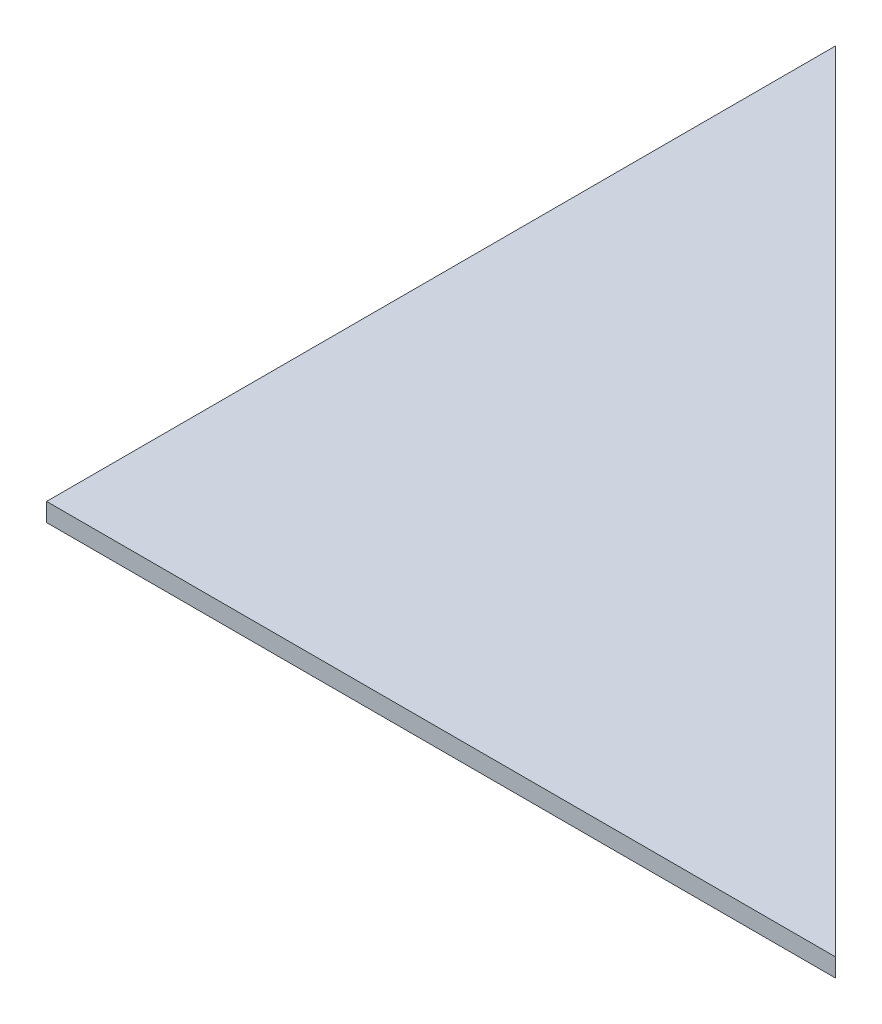
ISO-10303-21;
HEADER;
FILE_DESCRIPTION(('STEP AP214'),'2;1');
FILE_NAME('part.step','',(''),(''),'','','');
FILE_SCHEMA(('AUTOMOTIVE_DESIGN { 1 0 10303 214 1 1 1 1 }'));
ENDSEC;
DATA;
#1=APPLICATION_CONTEXT('core data for automotive mechanical design processes');
#2=APPLICATION_PROTOCOL_DEFINITION('international standard','automotive_design',2000,#1);
#3=PRODUCT_CONTEXT('',#1,'mechanical');
#4=PRODUCT('Part','Part','',(#3));
#5=PRODUCT_RELATED_PRODUCT_CATEGORY('part','',(#4));
#6=PRODUCT_DEFINITION_FORMATION('','',#4);
#7=PRODUCT_DEFINITION_CONTEXT('part definition',#1,'design');
#8=PRODUCT_DEFINITION('design','',#6,#7);
#9=PRODUCT_DEFINITION_SHAPE('','',#8);
#10=(LENGTH_UNIT() NAMED_UNIT(*) SI_UNIT(.MILLI.,.METRE.));
#11=(NAMED_UNIT(*) PLANE_ANGLE_UNIT() SI_UNIT($,.RADIAN.));
#12=(NAMED_UNIT(*) SI_UNIT($,.STERADIAN.) SOLID_ANGLE_UNIT());
#13=UNCERTAINTY_MEASURE_WITH_UNIT(LENGTH_MEASURE(1.E-05),#10,'distance_accuracy_value','');
#14=(GEOMETRIC_REPRESENTATION_CONTEXT(3) GLOBAL_UNCERTAINTY_ASSIGNED_CONTEXT((#13)) GLOBAL_UNIT_ASSIGNED_CONTEXT((#10,
#11,#12)) REPRESENTATION_CONTEXT('',''));
#15=CARTESIAN_POINT('',(0.,0.,0.));
#16=DIRECTION('',(0.,0.,1.));
#17=DIRECTION('',(1.,0.,0.));
#18=AXIS2_PLACEMENT_3D('',#15,#16,#17);
#19=CARTESIAN_POINT('',(0.,5.,0.));
#20=DIRECTION('',(0.,0.,-1.));
#21=DIRECTION('',(-1.,0.,0.));
#22=AXIS2_PLACEMENT_3D('',#19,#20,#21);
#23=PLANE('',#22);
#24=DIRECTION('',(1.,0.,0.));
#25=VECTOR('',#24,1.);
#26=CARTESIAN_POINT('',(0.,0.,0.));
#27=LINE('',#26,#25);
#28=CARTESIAN_POINT('',(0.,0.,0.));
#29=VERTEX_POINT('',#28);
#30=CARTESIAN_POINT('',(215.,0.,0.));
#31=VERTEX_POINT('',#30);
#32=EDGE_CURVE('E82',#29,#31,#27,.T.);
#33=ORIENTED_EDGE('',*,*,#32,.T.);
#34=DIRECTION('',(0.,-1.,0.));
#35=VECTOR('',#34,1.);
#36=CARTESIAN_POINT('',(215.,5.,0.));
#37=LINE('',#36,#35);
#38=CARTESIAN_POINT('',(215.,5.,0.));
#39=VERTEX_POINT('',#38);
#40=EDGE_CURVE('E11',#39,#31,#37,.T.);
#41=ORIENTED_EDGE('',*,*,#40,.F.);
#42=DIRECTION('',(1.,0.,0.));
#43=VECTOR('',#42,1.);
#44=CARTESIAN_POINT('',(0.,5.,0.));
#45=LINE('',#44,#43);
#46=CARTESIAN_POINT('',(0.,5.,0.));
#47=VERTEX_POINT('',#46);
#48=EDGE_CURVE('E75',#47,#39,#45,.T.);
#49=ORIENTED_EDGE('',*,*,#48,.F.);
#50=DIRECTION('',(0.,-1.,0.));
#51=VECTOR('',#50,1.);
#52=CARTESIAN_POINT('',(0.,5.,0.));
#53=LINE('',#52,#51);
#54=EDGE_CURVE('E83',#47,#29,#53,.T.);
#55=ORIENTED_EDGE('',*,*,#54,.T.);
#56=EDGE_LOOP('',(#33,#41,#49,#55));
#57=FACE_BOUND('',#56,.T.);
#58=ADVANCED_FACE('F35',(#57),#23,.F.);
#59=CARTESIAN_POINT('',(0.,5.,-215.));
#60=DIRECTION('',(-0.707106781186548,0.,0.707106781186548));
#61=DIRECTION('',(0.707106781186548,0.,0.707106781186548));
#62=AXIS2_PLACEMENT_3D('',#59,#60,#61);
#63=PLANE('',#62);
#64=DIRECTION('',(-0.707106781186547,0.,-0.707106781186547));
#65=VECTOR('',#64,1.);
#66=CARTESIAN_POINT('',(0.,0.,-215.));
#67=LINE('',#66,#65);
#68=CARTESIAN_POINT('',(0.,0.,-215.));
#69=VERTEX_POINT('',#68);
#70=EDGE_CURVE('E63',#31,#69,#67,.T.);
#71=ORIENTED_EDGE('',*,*,#70,.T.);
#72=DIRECTION('',(0.,-1.,0.));
#73=VECTOR('',#72,1.);
#74=CARTESIAN_POINT('',(0.,5.,-215.));
#75=LINE('',#74,#73);
#76=CARTESIAN_POINT('',(0.,5.,-215.));
#77=VERTEX_POINT('',#76);
#78=EDGE_CURVE('E43',#77,#69,#75,.T.);
#79=ORIENTED_EDGE('',*,*,#78,.F.);
#80=DIRECTION('',(-0.707106781186547,0.,-0.707106781186547));
#81=VECTOR('',#80,1.);
#82=CARTESIAN_POINT('',(0.,5.,-215.));
#83=LINE('',#82,#81);
#84=EDGE_CURVE('E71',#39,#77,#83,.T.);
#85=ORIENTED_EDGE('',*,*,#84,.F.);
#86=ORIENTED_EDGE('',*,*,#40,.T.);
#87=EDGE_LOOP('',(#71,#79,#85,#86));
#88=FACE_BOUND('',#87,.T.);
#89=ADVANCED_FACE('F72',(#88),#63,.F.);
#90=CARTESIAN_POINT('',(0.,5.,0.));
#91=DIRECTION('',(1.,0.,0.));
#92=DIRECTION('',(0.,0.,-1.));
#93=AXIS2_PLACEMENT_3D('',#90,#91,#92);
#94=PLANE('',#93);
#95=DIRECTION('',(0.,0.,1.));
#96=VECTOR('',#95,1.);
#97=CARTESIAN_POINT('',(0.,0.,0.));
#98=LINE('',#97,#96);
#99=EDGE_CURVE('E68',#69,#29,#98,.T.);
#100=ORIENTED_EDGE('',*,*,#99,.T.);
#101=ORIENTED_EDGE('',*,*,#54,.F.);
#102=DIRECTION('',(0.,0.,1.));
#103=VECTOR('',#102,1.);
#104=CARTESIAN_POINT('',(0.,5.,0.));
#105=LINE('',#104,#103);
#106=EDGE_CURVE('E51',#77,#47,#105,.T.);
#107=ORIENTED_EDGE('',*,*,#106,.F.);
#108=ORIENTED_EDGE('',*,*,#78,.T.);
#109=EDGE_LOOP('',(#100,#101,#107,#108));
#110=FACE_BOUND('',#109,.T.);
#111=ADVANCED_FACE('F90',(#110),#94,.F.);
#112=CARTESIAN_POINT('',(0.,5.,0.));
#113=DIRECTION('',(0.,1.,0.));
#114=DIRECTION('',(0.,0.,1.));
#115=AXIS2_PLACEMENT_3D('',#112,#113,#114);
#116=PLANE('',#115);
#117=ORIENTED_EDGE('',*,*,#48,.T.);
#118=ORIENTED_EDGE('',*,*,#84,.T.);
#119=ORIENTED_EDGE('',*,*,#106,.T.);
#120=EDGE_LOOP('',(#117,#118,#119));
#121=FACE_BOUND('',#120,.T.);
#122=ADVANCED_FACE('F78',(#121),#116,.T.);
#123=CARTESIAN_POINT('',(0.,0.,0.));
#124=DIRECTION('',(0.,1.,0.));
#125=DIRECTION('',(0.,0.,1.));
#126=AXIS2_PLACEMENT_3D('',#123,#124,#125);
#127=PLANE('',#126);
#128=ORIENTED_EDGE('',*,*,#32,.F.);
#129=ORIENTED_EDGE('',*,*,#99,.F.);
#130=ORIENTED_EDGE('',*,*,#70,.F.);
#131=EDGE_LOOP('',(#128,#129,#130));
#132=FACE_BOUND('',#131,.T.);
#133=ADVANCED_FACE('F91',(#132),#127,.F.);
#134=CLOSED_SHELL('',(#58,#89,#111,#122,#133));
#135=MANIFOLD_SOLID_BREP('B2',#134);
#136=ADVANCED_BREP_SHAPE_REPRESENTATION('',(#18,#135),#14);
#137=SHAPE_DEFINITION_REPRESENTATION(#9,#136);
ENDSEC;
END-ISO-10303-21;
